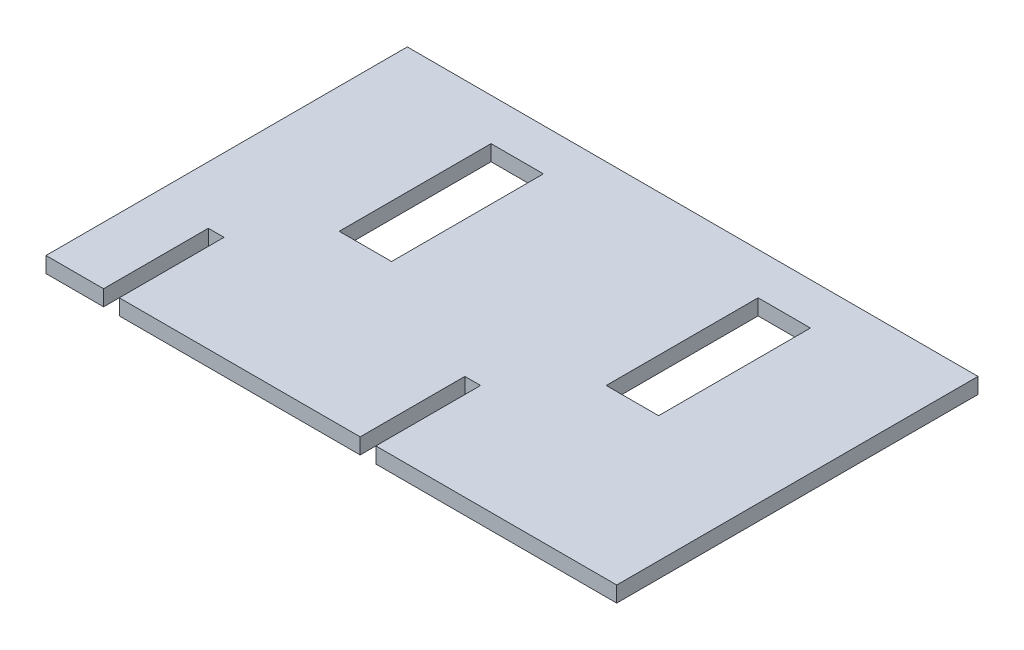
ISO-10303-21;
HEADER;
FILE_DESCRIPTION(('STEP AP214'),'2;1');
FILE_NAME('part.step','',(''),(''),'','','');
FILE_SCHEMA(('AUTOMOTIVE_DESIGN { 1 0 10303 214 1 1 1 1 }'));
ENDSEC;
DATA;
#1=APPLICATION_CONTEXT('core data for automotive mechanical design processes');
#2=APPLICATION_PROTOCOL_DEFINITION('international standard','automotive_design',2000,#1);
#3=PRODUCT_CONTEXT('',#1,'mechanical');
#4=PRODUCT('Part','Part','',(#3));
#5=PRODUCT_RELATED_PRODUCT_CATEGORY('part','',(#4));
#6=PRODUCT_DEFINITION_FORMATION('','',#4);
#7=PRODUCT_DEFINITION_CONTEXT('part definition',#1,'design');
#8=PRODUCT_DEFINITION('design','',#6,#7);
#9=PRODUCT_DEFINITION_SHAPE('','',#8);
#10=(LENGTH_UNIT() NAMED_UNIT(*) SI_UNIT(.MILLI.,.METRE.));
#11=(NAMED_UNIT(*) PLANE_ANGLE_UNIT() SI_UNIT($,.RADIAN.));
#12=(NAMED_UNIT(*) SI_UNIT($,.STERADIAN.) SOLID_ANGLE_UNIT());
#13=UNCERTAINTY_MEASURE_WITH_UNIT(LENGTH_MEASURE(1.E-05),#10,'distance_accuracy_value','');
#14=(GEOMETRIC_REPRESENTATION_CONTEXT(3) GLOBAL_UNCERTAINTY_ASSIGNED_CONTEXT((#13)) GLOBAL_UNIT_ASSIGNED_CONTEXT((#10,
#11,#12)) REPRESENTATION_CONTEXT('',''));
#15=CARTESIAN_POINT('',(0.,0.,0.));
#16=DIRECTION('',(0.,0.,1.));
#17=DIRECTION('',(1.,0.,0.));
#18=AXIS2_PLACEMENT_3D('',#15,#16,#17);
#19=CARTESIAN_POINT('',(-27.25,1.5,17.25));
#20=DIRECTION('',(0.,0.,-1.));
#21=DIRECTION('',(-1.,0.,0.));
#22=AXIS2_PLACEMENT_3D('',#19,#20,#21);
#23=PLANE('',#22);
#24=DIRECTION('',(1.,0.,0.));
#25=VECTOR('',#24,1.);
#26=CARTESIAN_POINT('',(-27.25,0.,17.25));
#27=LINE('',#26,#25);
#28=CARTESIAN_POINT('',(-20.25,0.,17.25));
#29=VERTEX_POINT('',#28);
#30=CARTESIAN_POINT('',(2.75,0.,17.25));
#31=VERTEX_POINT('',#30);
#32=EDGE_CURVE('E187',#29,#31,#27,.T.);
#33=ORIENTED_EDGE('',*,*,#32,.T.);
#34=DIRECTION('',(0.,1.,0.));
#35=VECTOR('',#34,1.);
#36=CARTESIAN_POINT('',(2.75,-0.5,17.25));
#37=LINE('',#36,#35);
#38=CARTESIAN_POINT('',(2.75,1.5,17.25));
#39=VERTEX_POINT('',#38);
#40=EDGE_CURVE('E172',#31,#39,#37,.T.);
#41=ORIENTED_EDGE('',*,*,#40,.T.);
#42=DIRECTION('',(1.,0.,0.));
#43=VECTOR('',#42,1.);
#44=CARTESIAN_POINT('',(-27.25,1.5,17.25));
#45=LINE('',#44,#43);
#46=CARTESIAN_POINT('',(-20.25,1.5,17.25));
#47=VERTEX_POINT('',#46);
#48=EDGE_CURVE('E185',#47,#39,#45,.T.);
#49=ORIENTED_EDGE('',*,*,#48,.F.);
#50=DIRECTION('',(0.,1.,0.));
#51=VECTOR('',#50,1.);
#52=CARTESIAN_POINT('',(-20.25,-0.5,17.25));
#53=LINE('',#52,#51);
#54=EDGE_CURVE('E282',#29,#47,#53,.T.);
#55=ORIENTED_EDGE('',*,*,#54,.F.);
#56=EDGE_LOOP('',(#33,#41,#49,#55));
#57=FACE_BOUND('',#56,.T.);
#58=ADVANCED_FACE('F33',(#57),#23,.F.);
#59=CARTESIAN_POINT('',(-27.25,0.,17.25));
#60=VERTEX_POINT('',#59);
#61=CARTESIAN_POINT('',(-21.75,0.,17.25));
#62=VERTEX_POINT('',#61);
#63=EDGE_CURVE('E214',#60,#62,#27,.T.);
#64=ORIENTED_EDGE('',*,*,#63,.T.);
#65=DIRECTION('',(0.,1.,0.));
#66=VECTOR('',#65,1.);
#67=CARTESIAN_POINT('',(-21.75,-0.5,17.25));
#68=LINE('',#67,#66);
#69=CARTESIAN_POINT('',(-21.75,1.5,17.25));
#70=VERTEX_POINT('',#69);
#71=EDGE_CURVE('E283',#62,#70,#68,.T.);
#72=ORIENTED_EDGE('',*,*,#71,.T.);
#73=CARTESIAN_POINT('',(-27.25,1.5,17.25));
#74=VERTEX_POINT('',#73);
#75=EDGE_CURVE('E196',#74,#70,#45,.T.);
#76=ORIENTED_EDGE('',*,*,#75,.F.);
#77=DIRECTION('',(0.,-1.,0.));
#78=VECTOR('',#77,1.);
#79=CARTESIAN_POINT('',(-27.25,1.5,17.25));
#80=LINE('',#79,#78);
#81=EDGE_CURVE('E220',#74,#60,#80,.T.);
#82=ORIENTED_EDGE('',*,*,#81,.T.);
#83=EDGE_LOOP('',(#64,#72,#76,#82));
#84=FACE_BOUND('',#83,.T.);
#85=ADVANCED_FACE('F341',(#84),#23,.F.);
#86=CARTESIAN_POINT('',(27.25,1.5,-17.25));
#87=DIRECTION('',(-1.,0.,0.));
#88=DIRECTION('',(0.,0.,1.));
#89=AXIS2_PLACEMENT_3D('',#86,#87,#88);
#90=PLANE('',#89);
#91=DIRECTION('',(0.,0.,-1.));
#92=VECTOR('',#91,1.);
#93=CARTESIAN_POINT('',(27.25,0.,-17.25));
#94=LINE('',#93,#92);
#95=CARTESIAN_POINT('',(27.25,0.,17.25));
#96=VERTEX_POINT('',#95);
#97=CARTESIAN_POINT('',(27.25,0.,-17.25));
#98=VERTEX_POINT('',#97);
#99=EDGE_CURVE('E205',#96,#98,#94,.T.);
#100=ORIENTED_EDGE('',*,*,#99,.T.);
#101=DIRECTION('',(0.,-1.,0.));
#102=VECTOR('',#101,1.);
#103=CARTESIAN_POINT('',(27.25,1.5,-17.25));
#104=LINE('',#103,#102);
#105=CARTESIAN_POINT('',(27.25,1.5,-17.25));
#106=VERTEX_POINT('',#105);
#107=EDGE_CURVE('E226',#106,#98,#104,.T.);
#108=ORIENTED_EDGE('',*,*,#107,.F.);
#109=DIRECTION('',(0.,0.,-1.));
#110=VECTOR('',#109,1.);
#111=CARTESIAN_POINT('',(27.25,1.5,-17.25));
#112=LINE('',#111,#110);
#113=CARTESIAN_POINT('',(27.25,1.5,17.25));
#114=VERTEX_POINT('',#113);
#115=EDGE_CURVE('E217',#114,#106,#112,.T.);
#116=ORIENTED_EDGE('',*,*,#115,.F.);
#117=DIRECTION('',(0.,-1.,0.));
#118=VECTOR('',#117,1.);
#119=CARTESIAN_POINT('',(27.25,1.5,17.25));
#120=LINE('',#119,#118);
#121=EDGE_CURVE('E200',#114,#96,#120,.T.);
#122=ORIENTED_EDGE('',*,*,#121,.T.);
#123=EDGE_LOOP('',(#100,#108,#116,#122));
#124=FACE_BOUND('',#123,.T.);
#125=ADVANCED_FACE('F35',(#124),#90,.F.);
#126=CARTESIAN_POINT('',(-27.25,1.5,-17.25));
#127=DIRECTION('',(0.,0.,1.));
#128=DIRECTION('',(1.,0.,0.));
#129=AXIS2_PLACEMENT_3D('',#126,#127,#128);
#130=PLANE('',#129);
#131=DIRECTION('',(-1.,0.,0.));
#132=VECTOR('',#131,1.);
#133=CARTESIAN_POINT('',(-27.25,0.,-17.25));
#134=LINE('',#133,#132);
#135=CARTESIAN_POINT('',(-27.25,0.,-17.25));
#136=VERTEX_POINT('',#135);
#137=EDGE_CURVE('E208',#98,#136,#134,.T.);
#138=ORIENTED_EDGE('',*,*,#137,.T.);
#139=DIRECTION('',(0.,-1.,0.));
#140=VECTOR('',#139,1.);
#141=CARTESIAN_POINT('',(-27.25,1.5,-17.25));
#142=LINE('',#141,#140);
#143=CARTESIAN_POINT('',(-27.25,1.5,-17.25));
#144=VERTEX_POINT('',#143);
#145=EDGE_CURVE('E223',#144,#136,#142,.T.);
#146=ORIENTED_EDGE('',*,*,#145,.F.);
#147=DIRECTION('',(-1.,0.,0.));
#148=VECTOR('',#147,1.);
#149=CARTESIAN_POINT('',(-27.25,1.5,-17.25));
#150=LINE('',#149,#148);
#151=EDGE_CURVE('E330',#106,#144,#150,.T.);
#152=ORIENTED_EDGE('',*,*,#151,.F.);
#153=ORIENTED_EDGE('',*,*,#107,.T.);
#154=EDGE_LOOP('',(#138,#146,#152,#153));
#155=FACE_BOUND('',#154,.T.);
#156=ADVANCED_FACE('F358',(#155),#130,.F.);
#157=CARTESIAN_POINT('',(-27.25,1.5,-17.25));
#158=DIRECTION('',(1.,0.,0.));
#159=DIRECTION('',(0.,0.,-1.));
#160=AXIS2_PLACEMENT_3D('',#157,#158,#159);
#161=PLANE('',#160);
#162=DIRECTION('',(0.,0.,1.));
#163=VECTOR('',#162,1.);
#164=CARTESIAN_POINT('',(-27.25,0.,-17.25));
#165=LINE('',#164,#163);
#166=EDGE_CURVE('E211',#136,#60,#165,.T.);
#167=ORIENTED_EDGE('',*,*,#166,.T.);
#168=ORIENTED_EDGE('',*,*,#81,.F.);
#169=DIRECTION('',(0.,0.,1.));
#170=VECTOR('',#169,1.);
#171=CARTESIAN_POINT('',(-27.25,1.5,-17.25));
#172=LINE('',#171,#170);
#173=EDGE_CURVE('E201',#144,#74,#172,.T.);
#174=ORIENTED_EDGE('',*,*,#173,.F.);
#175=ORIENTED_EDGE('',*,*,#145,.T.);
#176=EDGE_LOOP('',(#167,#168,#174,#175));
#177=FACE_BOUND('',#176,.T.);
#178=ADVANCED_FACE('F337',(#177),#161,.F.);
#179=CARTESIAN_POINT('',(4.25,1.5,17.25));
#180=VERTEX_POINT('',#179);
#181=EDGE_CURVE('E197',#180,#114,#45,.T.);
#182=ORIENTED_EDGE('',*,*,#181,.F.);
#183=DIRECTION('',(0.,1.,0.));
#184=VECTOR('',#183,1.);
#185=CARTESIAN_POINT('',(4.25,-0.5,17.25));
#186=LINE('',#185,#184);
#187=CARTESIAN_POINT('',(4.25,0.,17.25));
#188=VERTEX_POINT('',#187);
#189=EDGE_CURVE('E188',#188,#180,#186,.T.);
#190=ORIENTED_EDGE('',*,*,#189,.F.);
#191=EDGE_CURVE('E213',#188,#96,#27,.T.);
#192=ORIENTED_EDGE('',*,*,#191,.T.);
#193=ORIENTED_EDGE('',*,*,#121,.F.);
#194=EDGE_LOOP('',(#182,#190,#192,#193));
#195=FACE_BOUND('',#194,.T.);
#196=ADVANCED_FACE('F352',(#195),#23,.F.);
#197=CARTESIAN_POINT('',(0.,1.5,0.));
#198=DIRECTION('',(0.,1.,0.));
#199=DIRECTION('',(0.,0.,1.));
#200=AXIS2_PLACEMENT_3D('',#197,#198,#199);
#201=PLANE('',#200);
#202=DIRECTION('',(0.,0.,1.));
#203=VECTOR('',#202,1.);
#204=CARTESIAN_POINT('',(2.75,1.5,17.25));
#205=LINE('',#204,#203);
#206=CARTESIAN_POINT('',(2.75,1.5,7.25));
#207=VERTEX_POINT('',#206);
#208=EDGE_CURVE('E169',#207,#39,#205,.T.);
#209=ORIENTED_EDGE('',*,*,#208,.F.);
#210=DIRECTION('',(-1.,0.,0.));
#211=VECTOR('',#210,1.);
#212=CARTESIAN_POINT('',(2.75,1.5,7.25));
#213=LINE('',#212,#211);
#214=CARTESIAN_POINT('',(4.25,1.5,7.25));
#215=VERTEX_POINT('',#214);
#216=EDGE_CURVE('E189',#215,#207,#213,.T.);
#217=ORIENTED_EDGE('',*,*,#216,.F.);
#218=DIRECTION('',(0.,0.,-1.));
#219=VECTOR('',#218,1.);
#220=CARTESIAN_POINT('',(4.25,1.5,7.25));
#221=LINE('',#220,#219);
#222=EDGE_CURVE('E179',#180,#215,#221,.T.);
#223=ORIENTED_EDGE('',*,*,#222,.F.);
#224=ORIENTED_EDGE('',*,*,#181,.T.);
#225=ORIENTED_EDGE('',*,*,#115,.T.);
#226=ORIENTED_EDGE('',*,*,#151,.T.);
#227=ORIENTED_EDGE('',*,*,#173,.T.);
#228=ORIENTED_EDGE('',*,*,#75,.T.);
#229=DIRECTION('',(0.,0.,1.));
#230=VECTOR('',#229,1.);
#231=CARTESIAN_POINT('',(-21.75,1.5,17.25));
#232=LINE('',#231,#230);
#233=CARTESIAN_POINT('',(-21.75,1.5,7.25));
#234=VERTEX_POINT('',#233);
#235=EDGE_CURVE('E280',#234,#70,#232,.T.);
#236=ORIENTED_EDGE('',*,*,#235,.F.);
#237=DIRECTION('',(-1.,0.,0.));
#238=VECTOR('',#237,1.);
#239=CARTESIAN_POINT('',(-21.75,1.5,7.25));
#240=LINE('',#239,#238);
#241=CARTESIAN_POINT('',(-20.25,1.5,7.25));
#242=VERTEX_POINT('',#241);
#243=EDGE_CURVE('E271',#242,#234,#240,.T.);
#244=ORIENTED_EDGE('',*,*,#243,.F.);
#245=DIRECTION('',(0.,0.,-1.));
#246=VECTOR('',#245,1.);
#247=CARTESIAN_POINT('',(-20.25,1.5,7.25));
#248=LINE('',#247,#246);
#249=EDGE_CURVE('E195',#47,#242,#248,.T.);
#250=ORIENTED_EDGE('',*,*,#249,.F.);
#251=ORIENTED_EDGE('',*,*,#48,.T.);
#252=EDGE_LOOP('',(#209,#217,#223,#224,#225,#226,#227,#228,#236,#244,#250,#251));
#253=FACE_BOUND('',#252,.T.);
#254=DIRECTION('',(0.,0.,-1.));
#255=VECTOR('',#254,1.);
#256=CARTESIAN_POINT('',(15.25,1.5,-13.25));
#257=LINE('',#256,#255);
#258=CARTESIAN_POINT('',(15.25,1.5,1.25));
#259=VERTEX_POINT('',#258);
#260=CARTESIAN_POINT('',(15.25,1.5,-13.25));
#261=VERTEX_POINT('',#260);
#262=EDGE_CURVE('E286',#259,#261,#257,.T.);
#263=ORIENTED_EDGE('',*,*,#262,.F.);
#264=DIRECTION('',(1.,0.,0.));
#265=VECTOR('',#264,1.);
#266=CARTESIAN_POINT('',(10.25,1.5,1.25));
#267=LINE('',#266,#265);
#268=CARTESIAN_POINT('',(10.25,1.5,1.25));
#269=VERTEX_POINT('',#268);
#270=EDGE_CURVE('E298',#269,#259,#267,.T.);
#271=ORIENTED_EDGE('',*,*,#270,.F.);
#272=DIRECTION('',(0.,0.,1.));
#273=VECTOR('',#272,1.);
#274=CARTESIAN_POINT('',(10.25,1.5,-13.25));
#275=LINE('',#274,#273);
#276=CARTESIAN_POINT('',(10.25,1.5,-13.25));
#277=VERTEX_POINT('',#276);
#278=EDGE_CURVE('E295',#277,#269,#275,.T.);
#279=ORIENTED_EDGE('',*,*,#278,.F.);
#280=DIRECTION('',(-1.,0.,0.));
#281=VECTOR('',#280,1.);
#282=CARTESIAN_POINT('',(10.25,1.5,-13.25));
#283=LINE('',#282,#281);
#284=EDGE_CURVE('E292',#261,#277,#283,.T.);
#285=ORIENTED_EDGE('',*,*,#284,.F.);
#286=EDGE_LOOP('',(#263,#271,#279,#285));
#287=FACE_BOUND('',#286,.T.);
#288=DIRECTION('',(0.,0.,-1.));
#289=VECTOR('',#288,1.);
#290=CARTESIAN_POINT('',(-10.25,1.5,-13.25));
#291=LINE('',#290,#289);
#292=CARTESIAN_POINT('',(-10.25,1.5,1.25));
#293=VERTEX_POINT('',#292);
#294=CARTESIAN_POINT('',(-10.25,1.5,-13.25));
#295=VERTEX_POINT('',#294);
#296=EDGE_CURVE('E304',#293,#295,#291,.T.);
#297=ORIENTED_EDGE('',*,*,#296,.F.);
#298=DIRECTION('',(1.,0.,0.));
#299=VECTOR('',#298,1.);
#300=CARTESIAN_POINT('',(-15.25,1.5,1.25));
#301=LINE('',#300,#299);
#302=CARTESIAN_POINT('',(-15.25,1.5,1.25));
#303=VERTEX_POINT('',#302);
#304=EDGE_CURVE('E318',#303,#293,#301,.T.);
#305=ORIENTED_EDGE('',*,*,#304,.F.);
#306=DIRECTION('',(0.,0.,1.));
#307=VECTOR('',#306,1.);
#308=CARTESIAN_POINT('',(-15.25,1.5,-13.25));
#309=LINE('',#308,#307);
#310=CARTESIAN_POINT('',(-15.25,1.5,-13.25));
#311=VERTEX_POINT('',#310);
#312=EDGE_CURVE('E315',#311,#303,#309,.T.);
#313=ORIENTED_EDGE('',*,*,#312,.F.);
#314=DIRECTION('',(-1.,0.,0.));
#315=VECTOR('',#314,1.);
#316=CARTESIAN_POINT('',(-15.25,1.5,-13.25));
#317=LINE('',#316,#315);
#318=EDGE_CURVE('E312',#295,#311,#317,.T.);
#319=ORIENTED_EDGE('',*,*,#318,.F.);
#320=EDGE_LOOP('',(#297,#305,#313,#319));
#321=FACE_BOUND('',#320,.T.);
#322=ADVANCED_FACE('F192',(#253,#287,#321),#201,.T.);
#323=CARTESIAN_POINT('',(0.,0.,0.));
#324=DIRECTION('',(0.,1.,0.));
#325=DIRECTION('',(0.,0.,1.));
#326=AXIS2_PLACEMENT_3D('',#323,#324,#325);
#327=PLANE('',#326);
#328=DIRECTION('',(1.,0.,0.));
#329=VECTOR('',#328,1.);
#330=CARTESIAN_POINT('',(0.,0.,1.25));
#331=LINE('',#330,#329);
#332=CARTESIAN_POINT('',(10.25,0.,1.25));
#333=VERTEX_POINT('',#332);
#334=CARTESIAN_POINT('',(15.25,0.,1.25));
#335=VERTEX_POINT('',#334);
#336=EDGE_CURVE('E247',#333,#335,#331,.T.);
#337=ORIENTED_EDGE('',*,*,#336,.T.);
#338=DIRECTION('',(0.,0.,-1.));
#339=VECTOR('',#338,1.);
#340=CARTESIAN_POINT('',(15.25,0.,0.));
#341=LINE('',#340,#339);
#342=CARTESIAN_POINT('',(15.25,0.,-13.25));
#343=VERTEX_POINT('',#342);
#344=EDGE_CURVE('E250',#335,#343,#341,.T.);
#345=ORIENTED_EDGE('',*,*,#344,.T.);
#346=DIRECTION('',(-1.,0.,0.));
#347=VECTOR('',#346,1.);
#348=CARTESIAN_POINT('',(0.,0.,-13.25));
#349=LINE('',#348,#347);
#350=CARTESIAN_POINT('',(10.25,0.,-13.25));
#351=VERTEX_POINT('',#350);
#352=EDGE_CURVE('E241',#343,#351,#349,.T.);
#353=ORIENTED_EDGE('',*,*,#352,.T.);
#354=DIRECTION('',(0.,0.,1.));
#355=VECTOR('',#354,1.);
#356=CARTESIAN_POINT('',(10.25,0.,0.));
#357=LINE('',#356,#355);
#358=EDGE_CURVE('E244',#351,#333,#357,.T.);
#359=ORIENTED_EDGE('',*,*,#358,.T.);
#360=EDGE_LOOP('',(#337,#345,#353,#359));
#361=FACE_BOUND('',#360,.T.);
#362=DIRECTION('',(1.,0.,0.));
#363=VECTOR('',#362,1.);
#364=CARTESIAN_POINT('',(0.,0.,1.25));
#365=LINE('',#364,#363);
#366=CARTESIAN_POINT('',(-15.25,0.,1.25));
#367=VERTEX_POINT('',#366);
#368=CARTESIAN_POINT('',(-10.25,0.,1.25));
#369=VERTEX_POINT('',#368);
#370=EDGE_CURVE('E235',#367,#369,#365,.T.);
#371=ORIENTED_EDGE('',*,*,#370,.T.);
#372=DIRECTION('',(0.,0.,-1.));
#373=VECTOR('',#372,1.);
#374=CARTESIAN_POINT('',(-10.25,0.,0.));
#375=LINE('',#374,#373);
#376=CARTESIAN_POINT('',(-10.25,0.,-13.25));
#377=VERTEX_POINT('',#376);
#378=EDGE_CURVE('E238',#369,#377,#375,.T.);
#379=ORIENTED_EDGE('',*,*,#378,.T.);
#380=DIRECTION('',(-1.,0.,0.));
#381=VECTOR('',#380,1.);
#382=CARTESIAN_POINT('',(0.,0.,-13.25));
#383=LINE('',#382,#381);
#384=CARTESIAN_POINT('',(-15.25,0.,-13.25));
#385=VERTEX_POINT('',#384);
#386=EDGE_CURVE('E229',#377,#385,#383,.T.);
#387=ORIENTED_EDGE('',*,*,#386,.T.);
#388=DIRECTION('',(0.,0.,1.));
#389=VECTOR('',#388,1.);
#390=CARTESIAN_POINT('',(-15.25,0.,0.));
#391=LINE('',#390,#389);
#392=EDGE_CURVE('E232',#385,#367,#391,.T.);
#393=ORIENTED_EDGE('',*,*,#392,.T.);
#394=EDGE_LOOP('',(#371,#379,#387,#393));
#395=FACE_BOUND('',#394,.T.);
#396=DIRECTION('',(-1.,0.,0.));
#397=VECTOR('',#396,1.);
#398=CARTESIAN_POINT('',(0.,0.,7.25));
#399=LINE('',#398,#397);
#400=CARTESIAN_POINT('',(4.25,0.,7.25));
#401=VERTEX_POINT('',#400);
#402=CARTESIAN_POINT('',(2.75,0.,7.25));
#403=VERTEX_POINT('',#402);
#404=EDGE_CURVE('E41',#401,#403,#399,.T.);
#405=ORIENTED_EDGE('',*,*,#404,.T.);
#406=DIRECTION('',(0.,0.,1.));
#407=VECTOR('',#406,1.);
#408=CARTESIAN_POINT('',(2.75,0.,0.));
#409=LINE('',#408,#407);
#410=EDGE_CURVE('E11',#403,#31,#409,.T.);
#411=ORIENTED_EDGE('',*,*,#410,.T.);
#412=ORIENTED_EDGE('',*,*,#32,.F.);
#413=DIRECTION('',(0.,0.,-1.));
#414=VECTOR('',#413,1.);
#415=CARTESIAN_POINT('',(-20.25,0.,0.));
#416=LINE('',#415,#414);
#417=CARTESIAN_POINT('',(-20.25,0.,7.25));
#418=VERTEX_POINT('',#417);
#419=EDGE_CURVE('E253',#29,#418,#416,.T.);
#420=ORIENTED_EDGE('',*,*,#419,.T.);
#421=DIRECTION('',(-1.,0.,0.));
#422=VECTOR('',#421,1.);
#423=CARTESIAN_POINT('',(0.,0.,7.25));
#424=LINE('',#423,#422);
#425=CARTESIAN_POINT('',(-21.75,0.,7.25));
#426=VERTEX_POINT('',#425);
#427=EDGE_CURVE('E256',#418,#426,#424,.T.);
#428=ORIENTED_EDGE('',*,*,#427,.T.);
#429=DIRECTION('',(0.,0.,1.));
#430=VECTOR('',#429,1.);
#431=CARTESIAN_POINT('',(-21.75,0.,0.));
#432=LINE('',#431,#430);
#433=EDGE_CURVE('E259',#426,#62,#432,.T.);
#434=ORIENTED_EDGE('',*,*,#433,.T.);
#435=ORIENTED_EDGE('',*,*,#63,.F.);
#436=ORIENTED_EDGE('',*,*,#166,.F.);
#437=ORIENTED_EDGE('',*,*,#137,.F.);
#438=ORIENTED_EDGE('',*,*,#99,.F.);
#439=ORIENTED_EDGE('',*,*,#191,.F.);
#440=DIRECTION('',(0.,0.,-1.));
#441=VECTOR('',#440,1.);
#442=CARTESIAN_POINT('',(4.25,0.,0.));
#443=LINE('',#442,#441);
#444=EDGE_CURVE('E262',#188,#401,#443,.T.);
#445=ORIENTED_EDGE('',*,*,#444,.T.);
#446=EDGE_LOOP('',(#405,#411,#412,#420,#428,#434,#435,#436,#437,#438,#439,#445));
#447=FACE_BOUND('',#446,.T.);
#448=ADVANCED_FACE('F266',(#361,#395,#447),#327,.F.);
#449=CARTESIAN_POINT('',(-10.25,-0.5,-13.25));
#450=DIRECTION('',(1.,0.,0.));
#451=DIRECTION('',(0.,0.,-1.));
#452=AXIS2_PLACEMENT_3D('',#449,#450,#451);
#453=PLANE('',#452);
#454=DIRECTION('',(0.,1.,0.));
#455=VECTOR('',#454,1.);
#456=CARTESIAN_POINT('',(-10.25,-0.5,1.25));
#457=LINE('',#456,#455);
#458=EDGE_CURVE('E209',#369,#293,#457,.T.);
#459=ORIENTED_EDGE('',*,*,#458,.T.);
#460=ORIENTED_EDGE('',*,*,#296,.T.);
#461=DIRECTION('',(0.,1.,0.));
#462=VECTOR('',#461,1.);
#463=CARTESIAN_POINT('',(-10.25,-0.5,-13.25));
#464=LINE('',#463,#462);
#465=EDGE_CURVE('E321',#377,#295,#464,.T.);
#466=ORIENTED_EDGE('',*,*,#465,.F.);
#467=ORIENTED_EDGE('',*,*,#378,.F.);
#468=EDGE_LOOP('',(#459,#460,#466,#467));
#469=FACE_BOUND('',#468,.T.);
#470=ADVANCED_FACE('F449',(#469),#453,.F.);
#471=CARTESIAN_POINT('',(-15.25,-0.5,1.25));
#472=DIRECTION('',(0.,0.,1.));
#473=DIRECTION('',(1.,0.,0.));
#474=AXIS2_PLACEMENT_3D('',#471,#472,#473);
#475=PLANE('',#474);
#476=DIRECTION('',(0.,1.,0.));
#477=VECTOR('',#476,1.);
#478=CARTESIAN_POINT('',(-15.25,-0.5,1.25));
#479=LINE('',#478,#477);
#480=EDGE_CURVE('E323',#367,#303,#479,.T.);
#481=ORIENTED_EDGE('',*,*,#480,.T.);
#482=ORIENTED_EDGE('',*,*,#304,.T.);
#483=ORIENTED_EDGE('',*,*,#458,.F.);
#484=ORIENTED_EDGE('',*,*,#370,.F.);
#485=EDGE_LOOP('',(#481,#482,#483,#484));
#486=FACE_BOUND('',#485,.T.);
#487=ADVANCED_FACE('F486',(#486),#475,.F.);
#488=CARTESIAN_POINT('',(-15.25,-0.5,-13.25));
#489=DIRECTION('',(-1.,0.,0.));
#490=DIRECTION('',(0.,0.,1.));
#491=AXIS2_PLACEMENT_3D('',#488,#489,#490);
#492=PLANE('',#491);
#493=DIRECTION('',(0.,1.,0.));
#494=VECTOR('',#493,1.);
#495=CARTESIAN_POINT('',(-15.25,-0.5,-13.25));
#496=LINE('',#495,#494);
#497=EDGE_CURVE('E325',#385,#311,#496,.T.);
#498=ORIENTED_EDGE('',*,*,#497,.T.);
#499=ORIENTED_EDGE('',*,*,#312,.T.);
#500=ORIENTED_EDGE('',*,*,#480,.F.);
#501=ORIENTED_EDGE('',*,*,#392,.F.);
#502=EDGE_LOOP('',(#498,#499,#500,#501));
#503=FACE_BOUND('',#502,.T.);
#504=ADVANCED_FACE('F489',(#503),#492,.F.);
#505=CARTESIAN_POINT('',(-15.25,-0.5,-13.25));
#506=DIRECTION('',(0.,0.,-1.));
#507=DIRECTION('',(-1.,0.,0.));
#508=AXIS2_PLACEMENT_3D('',#505,#506,#507);
#509=PLANE('',#508);
#510=ORIENTED_EDGE('',*,*,#465,.T.);
#511=ORIENTED_EDGE('',*,*,#318,.T.);
#512=ORIENTED_EDGE('',*,*,#497,.F.);
#513=ORIENTED_EDGE('',*,*,#386,.F.);
#514=EDGE_LOOP('',(#510,#511,#512,#513));
#515=FACE_BOUND('',#514,.T.);
#516=ADVANCED_FACE('F484',(#515),#509,.F.);
#517=CARTESIAN_POINT('',(15.25,-0.5,-13.25));
#518=DIRECTION('',(1.,0.,0.));
#519=DIRECTION('',(0.,0.,-1.));
#520=AXIS2_PLACEMENT_3D('',#517,#518,#519);
#521=PLANE('',#520);
#522=DIRECTION('',(0.,1.,0.));
#523=VECTOR('',#522,1.);
#524=CARTESIAN_POINT('',(15.25,-0.5,1.25));
#525=LINE('',#524,#523);
#526=EDGE_CURVE('E302',#335,#259,#525,.T.);
#527=ORIENTED_EDGE('',*,*,#526,.T.);
#528=ORIENTED_EDGE('',*,*,#262,.T.);
#529=DIRECTION('',(0.,1.,0.));
#530=VECTOR('',#529,1.);
#531=CARTESIAN_POINT('',(15.25,-0.5,-13.25));
#532=LINE('',#531,#530);
#533=EDGE_CURVE('E301',#343,#261,#532,.T.);
#534=ORIENTED_EDGE('',*,*,#533,.F.);
#535=ORIENTED_EDGE('',*,*,#344,.F.);
#536=EDGE_LOOP('',(#527,#528,#534,#535));
#537=FACE_BOUND('',#536,.T.);
#538=ADVANCED_FACE('F475',(#537),#521,.F.);
#539=CARTESIAN_POINT('',(10.25,-0.5,1.25));
#540=DIRECTION('',(0.,0.,1.));
#541=DIRECTION('',(1.,0.,0.));
#542=AXIS2_PLACEMENT_3D('',#539,#540,#541);
#543=PLANE('',#542);
#544=DIRECTION('',(0.,1.,0.));
#545=VECTOR('',#544,1.);
#546=CARTESIAN_POINT('',(10.25,-0.5,1.25));
#547=LINE('',#546,#545);
#548=EDGE_CURVE('E305',#333,#269,#547,.T.);
#549=ORIENTED_EDGE('',*,*,#548,.T.);
#550=ORIENTED_EDGE('',*,*,#270,.T.);
#551=ORIENTED_EDGE('',*,*,#526,.F.);
#552=ORIENTED_EDGE('',*,*,#336,.F.);
#553=EDGE_LOOP('',(#549,#550,#551,#552));
#554=FACE_BOUND('',#553,.T.);
#555=ADVANCED_FACE('F471',(#554),#543,.F.);
#556=CARTESIAN_POINT('',(10.25,-0.5,-13.25));
#557=DIRECTION('',(-1.,0.,0.));
#558=DIRECTION('',(0.,0.,1.));
#559=AXIS2_PLACEMENT_3D('',#556,#557,#558);
#560=PLANE('',#559);
#561=DIRECTION('',(0.,1.,0.));
#562=VECTOR('',#561,1.);
#563=CARTESIAN_POINT('',(10.25,-0.5,-13.25));
#564=LINE('',#563,#562);
#565=EDGE_CURVE('E307',#351,#277,#564,.T.);
#566=ORIENTED_EDGE('',*,*,#565,.T.);
#567=ORIENTED_EDGE('',*,*,#278,.T.);
#568=ORIENTED_EDGE('',*,*,#548,.F.);
#569=ORIENTED_EDGE('',*,*,#358,.F.);
#570=EDGE_LOOP('',(#566,#567,#568,#569));
#571=FACE_BOUND('',#570,.T.);
#572=ADVANCED_FACE('F474',(#571),#560,.F.);
#573=CARTESIAN_POINT('',(10.25,-0.5,-13.25));
#574=DIRECTION('',(0.,0.,-1.));
#575=DIRECTION('',(-1.,0.,0.));
#576=AXIS2_PLACEMENT_3D('',#573,#574,#575);
#577=PLANE('',#576);
#578=ORIENTED_EDGE('',*,*,#533,.T.);
#579=ORIENTED_EDGE('',*,*,#284,.T.);
#580=ORIENTED_EDGE('',*,*,#565,.F.);
#581=ORIENTED_EDGE('',*,*,#352,.F.);
#582=EDGE_LOOP('',(#578,#579,#580,#581));
#583=FACE_BOUND('',#582,.T.);
#584=ADVANCED_FACE('F401',(#583),#577,.F.);
#585=CARTESIAN_POINT('',(-21.75,-0.5,17.25));
#586=DIRECTION('',(-1.,0.,0.));
#587=DIRECTION('',(0.,0.,1.));
#588=AXIS2_PLACEMENT_3D('',#585,#586,#587);
#589=PLANE('',#588);
#590=DIRECTION('',(0.,1.,0.));
#591=VECTOR('',#590,1.);
#592=CARTESIAN_POINT('',(-21.75,-0.5,7.25));
#593=LINE('',#592,#591);
#594=EDGE_CURVE('E287',#426,#234,#593,.T.);
#595=ORIENTED_EDGE('',*,*,#594,.T.);
#596=ORIENTED_EDGE('',*,*,#235,.T.);
#597=ORIENTED_EDGE('',*,*,#71,.F.);
#598=ORIENTED_EDGE('',*,*,#433,.F.);
#599=EDGE_LOOP('',(#595,#596,#597,#598));
#600=FACE_BOUND('',#599,.T.);
#601=ADVANCED_FACE('F343',(#600),#589,.F.);
#602=CARTESIAN_POINT('',(-21.75,-0.5,7.25));
#603=DIRECTION('',(0.,0.,-1.));
#604=DIRECTION('',(-1.,0.,0.));
#605=AXIS2_PLACEMENT_3D('',#602,#603,#604);
#606=PLANE('',#605);
#607=DIRECTION('',(0.,1.,0.));
#608=VECTOR('',#607,1.);
#609=CARTESIAN_POINT('',(-20.25,-0.5,7.25));
#610=LINE('',#609,#608);
#611=EDGE_CURVE('E56',#418,#242,#610,.T.);
#612=ORIENTED_EDGE('',*,*,#611,.T.);
#613=ORIENTED_EDGE('',*,*,#243,.T.);
#614=ORIENTED_EDGE('',*,*,#594,.F.);
#615=ORIENTED_EDGE('',*,*,#427,.F.);
#616=EDGE_LOOP('',(#612,#613,#614,#615));
#617=FACE_BOUND('',#616,.T.);
#618=ADVANCED_FACE('F346',(#617),#606,.F.);
#619=CARTESIAN_POINT('',(-20.25,-0.5,7.25));
#620=DIRECTION('',(1.,0.,0.));
#621=DIRECTION('',(0.,0.,-1.));
#622=AXIS2_PLACEMENT_3D('',#619,#620,#621);
#623=PLANE('',#622);
#624=ORIENTED_EDGE('',*,*,#54,.T.);
#625=ORIENTED_EDGE('',*,*,#249,.T.);
#626=ORIENTED_EDGE('',*,*,#611,.F.);
#627=ORIENTED_EDGE('',*,*,#419,.F.);
#628=EDGE_LOOP('',(#624,#625,#626,#627));
#629=FACE_BOUND('',#628,.T.);
#630=ADVANCED_FACE('F347',(#629),#623,.F.);
#631=CARTESIAN_POINT('',(2.75,-0.5,17.25));
#632=DIRECTION('',(-1.,0.,0.));
#633=DIRECTION('',(0.,0.,1.));
#634=AXIS2_PLACEMENT_3D('',#631,#632,#633);
#635=PLANE('',#634);
#636=DIRECTION('',(0.,1.,0.));
#637=VECTOR('',#636,1.);
#638=CARTESIAN_POINT('',(2.75,-0.5,7.25));
#639=LINE('',#638,#637);
#640=EDGE_CURVE('E174',#403,#207,#639,.T.);
#641=ORIENTED_EDGE('',*,*,#640,.T.);
#642=ORIENTED_EDGE('',*,*,#208,.T.);
#643=ORIENTED_EDGE('',*,*,#40,.F.);
#644=ORIENTED_EDGE('',*,*,#410,.F.);
#645=EDGE_LOOP('',(#641,#642,#643,#644));
#646=FACE_BOUND('',#645,.T.);
#647=ADVANCED_FACE('F171',(#646),#635,.F.);
#648=CARTESIAN_POINT('',(2.75,-0.5,7.25));
#649=DIRECTION('',(0.,0.,-1.));
#650=DIRECTION('',(-1.,0.,0.));
#651=AXIS2_PLACEMENT_3D('',#648,#649,#650);
#652=PLANE('',#651);
#653=DIRECTION('',(0.,1.,0.));
#654=VECTOR('',#653,1.);
#655=CARTESIAN_POINT('',(4.25,-0.5,7.25));
#656=LINE('',#655,#654);
#657=EDGE_CURVE('E48',#401,#215,#656,.T.);
#658=ORIENTED_EDGE('',*,*,#657,.T.);
#659=ORIENTED_EDGE('',*,*,#216,.T.);
#660=ORIENTED_EDGE('',*,*,#640,.F.);
#661=ORIENTED_EDGE('',*,*,#404,.F.);
#662=EDGE_LOOP('',(#658,#659,#660,#661));
#663=FACE_BOUND('',#662,.T.);
#664=ADVANCED_FACE('F269',(#663),#652,.F.);
#665=CARTESIAN_POINT('',(4.25,-0.5,7.25));
#666=DIRECTION('',(1.,0.,0.));
#667=DIRECTION('',(0.,0.,-1.));
#668=AXIS2_PLACEMENT_3D('',#665,#666,#667);
#669=PLANE('',#668);
#670=ORIENTED_EDGE('',*,*,#189,.T.);
#671=ORIENTED_EDGE('',*,*,#222,.T.);
#672=ORIENTED_EDGE('',*,*,#657,.F.);
#673=ORIENTED_EDGE('',*,*,#444,.F.);
#674=EDGE_LOOP('',(#670,#671,#672,#673));
#675=FACE_BOUND('',#674,.T.);
#676=ADVANCED_FACE('F360',(#675),#669,.F.);
#677=CLOSED_SHELL('',(#58,#85,#125,#156,#178,#196,#322,#448,#470,#487,#504,#516,#538,#555,#572,
#584,#601,#618,#630,#647,#664,#676));
#678=MANIFOLD_SOLID_BREP('B2',#677);
#679=ADVANCED_BREP_SHAPE_REPRESENTATION('',(#18,#678),#14);
#680=SHAPE_DEFINITION_REPRESENTATION(#9,#679);
ENDSEC;
END-ISO-10303-21;
